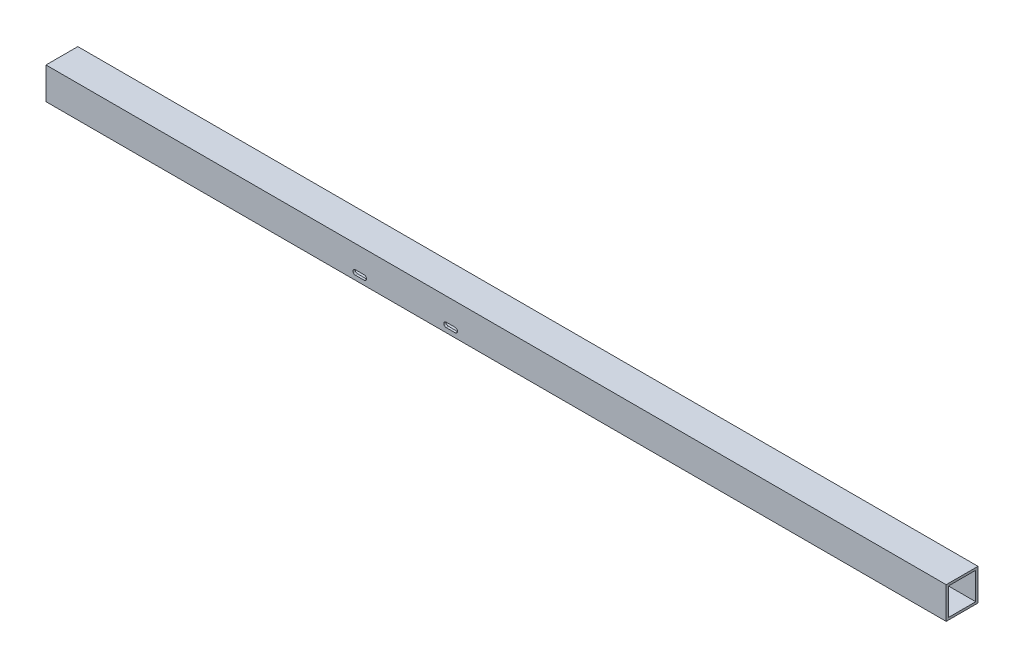
ISO-10303-21;
HEADER;
FILE_DESCRIPTION(('STEP AP214'),'2;1');
FILE_NAME('part.step','',(''),(''),'','','');
FILE_SCHEMA(('AUTOMOTIVE_DESIGN { 1 0 10303 214 1 1 1 1 }'));
ENDSEC;
DATA;
#1=APPLICATION_CONTEXT('core data for automotive mechanical design processes');
#2=APPLICATION_PROTOCOL_DEFINITION('international standard','automotive_design',2000,#1);
#3=PRODUCT_CONTEXT('',#1,'mechanical');
#4=PRODUCT('Part','Part','',(#3));
#5=PRODUCT_RELATED_PRODUCT_CATEGORY('part','',(#4));
#6=PRODUCT_DEFINITION_FORMATION('','',#4);
#7=PRODUCT_DEFINITION_CONTEXT('part definition',#1,'design');
#8=PRODUCT_DEFINITION('design','',#6,#7);
#9=PRODUCT_DEFINITION_SHAPE('','',#8);
#10=(LENGTH_UNIT() NAMED_UNIT(*) SI_UNIT(.MILLI.,.METRE.));
#11=(NAMED_UNIT(*) PLANE_ANGLE_UNIT() SI_UNIT($,.RADIAN.));
#12=(NAMED_UNIT(*) SI_UNIT($,.STERADIAN.) SOLID_ANGLE_UNIT());
#13=UNCERTAINTY_MEASURE_WITH_UNIT(LENGTH_MEASURE(1.E-05),#10,'distance_accuracy_value','');
#14=(GEOMETRIC_REPRESENTATION_CONTEXT(3) GLOBAL_UNCERTAINTY_ASSIGNED_CONTEXT((#13)) GLOBAL_UNIT_ASSIGNED_CONTEXT((#10,
#11,#12)) REPRESENTATION_CONTEXT('',''));
#15=CARTESIAN_POINT('',(0.,0.,0.));
#16=DIRECTION('',(0.,0.,1.));
#17=DIRECTION('',(1.,0.,0.));
#18=AXIS2_PLACEMENT_3D('',#15,#16,#17);
#19=CARTESIAN_POINT('',(628.65,0.,0.));
#20=DIRECTION('',(1.,0.,0.));
#21=DIRECTION('',(0.,0.,-1.));
#22=AXIS2_PLACEMENT_3D('',#19,#20,#21);
#23=PLANE('',#22);
#24=DIRECTION('',(0.,-1.,0.));
#25=VECTOR('',#24,1.);
#26=CARTESIAN_POINT('',(628.65,44.45,0.));
#27=LINE('',#26,#25);
#28=CARTESIAN_POINT('',(628.65,44.45,0.));
#29=VERTEX_POINT('',#28);
#30=CARTESIAN_POINT('',(628.65,0.,0.));
#31=VERTEX_POINT('',#30);
#32=EDGE_CURVE('E250',#29,#31,#27,.T.);
#33=ORIENTED_EDGE('',*,*,#32,.T.);
#34=DIRECTION('',(0.,0.,-1.));
#35=VECTOR('',#34,1.);
#36=CARTESIAN_POINT('',(628.65,0.,0.));
#37=LINE('',#36,#35);
#38=CARTESIAN_POINT('',(628.65,0.,-44.45));
#39=VERTEX_POINT('',#38);
#40=EDGE_CURVE('E253',#31,#39,#37,.T.);
#41=ORIENTED_EDGE('',*,*,#40,.T.);
#42=DIRECTION('',(0.,1.,0.));
#43=VECTOR('',#42,1.);
#44=CARTESIAN_POINT('',(628.65,0.,-44.45));
#45=LINE('',#44,#43);
#46=CARTESIAN_POINT('',(628.65,44.45,-44.45));
#47=VERTEX_POINT('',#46);
#48=EDGE_CURVE('E256',#39,#47,#45,.T.);
#49=ORIENTED_EDGE('',*,*,#48,.T.);
#50=DIRECTION('',(0.,0.,1.));
#51=VECTOR('',#50,1.);
#52=CARTESIAN_POINT('',(628.65,44.45,-44.45));
#53=LINE('',#52,#51);
#54=EDGE_CURVE('E258',#47,#29,#53,.T.);
#55=ORIENTED_EDGE('',*,*,#54,.T.);
#56=EDGE_LOOP('',(#33,#41,#49,#55));
#57=FACE_BOUND('',#56,.T.);
#58=DIRECTION('',(0.,0.,1.));
#59=VECTOR('',#58,1.);
#60=CARTESIAN_POINT('',(628.65,41.275,-41.275));
#61=LINE('',#60,#59);
#62=CARTESIAN_POINT('',(628.65,41.275,-41.275));
#63=VERTEX_POINT('',#62);
#64=CARTESIAN_POINT('',(628.65,41.275,-3.175));
#65=VERTEX_POINT('',#64);
#66=EDGE_CURVE('E221',#63,#65,#61,.T.);
#67=ORIENTED_EDGE('',*,*,#66,.F.);
#68=DIRECTION('',(0.,1.,0.));
#69=VECTOR('',#68,1.);
#70=CARTESIAN_POINT('',(628.65,3.175,-41.275));
#71=LINE('',#70,#69);
#72=CARTESIAN_POINT('',(628.65,3.175,-41.275));
#73=VERTEX_POINT('',#72);
#74=EDGE_CURVE('E219',#73,#63,#71,.T.);
#75=ORIENTED_EDGE('',*,*,#74,.F.);
#76=DIRECTION('',(0.,0.,-1.));
#77=VECTOR('',#76,1.);
#78=CARTESIAN_POINT('',(628.65,3.175,-3.17500000000001));
#79=LINE('',#78,#77);
#80=CARTESIAN_POINT('',(628.65,3.175,-3.17500000000001));
#81=VERTEX_POINT('',#80);
#82=EDGE_CURVE('E227',#81,#73,#79,.T.);
#83=ORIENTED_EDGE('',*,*,#82,.F.);
#84=DIRECTION('',(0.,-1.,0.));
#85=VECTOR('',#84,1.);
#86=CARTESIAN_POINT('',(628.65,41.275,-3.175));
#87=LINE('',#86,#85);
#88=EDGE_CURVE('E224',#65,#81,#87,.T.);
#89=ORIENTED_EDGE('',*,*,#88,.F.);
#90=EDGE_LOOP('',(#67,#75,#83,#89));
#91=FACE_BOUND('',#90,.T.);
#92=ADVANCED_FACE('F35',(#57,#91),#23,.T.);
#93=CARTESIAN_POINT('',(-628.65,0.,0.));
#94=DIRECTION('',(1.,0.,0.));
#95=DIRECTION('',(0.,0.,-1.));
#96=AXIS2_PLACEMENT_3D('',#93,#94,#95);
#97=PLANE('',#96);
#98=DIRECTION('',(0.,-1.,0.));
#99=VECTOR('',#98,1.);
#100=CARTESIAN_POINT('',(-628.65,44.45,0.));
#101=LINE('',#100,#99);
#102=CARTESIAN_POINT('',(-628.65,44.45,0.));
#103=VERTEX_POINT('',#102);
#104=CARTESIAN_POINT('',(-628.65,0.,0.));
#105=VERTEX_POINT('',#104);
#106=EDGE_CURVE('E249',#103,#105,#101,.T.);
#107=ORIENTED_EDGE('',*,*,#106,.F.);
#108=DIRECTION('',(0.,0.,1.));
#109=VECTOR('',#108,1.);
#110=CARTESIAN_POINT('',(-628.65,44.45,-44.45));
#111=LINE('',#110,#109);
#112=CARTESIAN_POINT('',(-628.65,44.45,-44.45));
#113=VERTEX_POINT('',#112);
#114=EDGE_CURVE('E254',#113,#103,#111,.T.);
#115=ORIENTED_EDGE('',*,*,#114,.F.);
#116=DIRECTION('',(0.,1.,0.));
#117=VECTOR('',#116,1.);
#118=CARTESIAN_POINT('',(-628.65,0.,-44.45));
#119=LINE('',#118,#117);
#120=CARTESIAN_POINT('',(-628.65,0.,-44.45));
#121=VERTEX_POINT('',#120);
#122=EDGE_CURVE('E265',#121,#113,#119,.T.);
#123=ORIENTED_EDGE('',*,*,#122,.F.);
#124=DIRECTION('',(0.,0.,-1.));
#125=VECTOR('',#124,1.);
#126=CARTESIAN_POINT('',(-628.65,0.,0.));
#127=LINE('',#126,#125);
#128=EDGE_CURVE('E263',#105,#121,#127,.T.);
#129=ORIENTED_EDGE('',*,*,#128,.F.);
#130=EDGE_LOOP('',(#107,#115,#123,#129));
#131=FACE_BOUND('',#130,.T.);
#132=DIRECTION('',(0.,1.,0.));
#133=VECTOR('',#132,1.);
#134=CARTESIAN_POINT('',(-628.65,3.175,-41.275));
#135=LINE('',#134,#133);
#136=CARTESIAN_POINT('',(-628.65,3.175,-41.275));
#137=VERTEX_POINT('',#136);
#138=CARTESIAN_POINT('',(-628.65,41.275,-41.275));
#139=VERTEX_POINT('',#138);
#140=EDGE_CURVE('E192',#137,#139,#135,.T.);
#141=ORIENTED_EDGE('',*,*,#140,.T.);
#142=DIRECTION('',(0.,0.,1.));
#143=VECTOR('',#142,1.);
#144=CARTESIAN_POINT('',(-628.65,41.275,-41.275));
#145=LINE('',#144,#143);
#146=CARTESIAN_POINT('',(-628.65,41.275,-3.175));
#147=VERTEX_POINT('',#146);
#148=EDGE_CURVE('E232',#139,#147,#145,.T.);
#149=ORIENTED_EDGE('',*,*,#148,.T.);
#150=DIRECTION('',(0.,-1.,0.));
#151=VECTOR('',#150,1.);
#152=CARTESIAN_POINT('',(-628.65,41.275,-3.175));
#153=LINE('',#152,#151);
#154=CARTESIAN_POINT('',(-628.65,3.175,-3.17500000000001));
#155=VERTEX_POINT('',#154);
#156=EDGE_CURVE('E235',#147,#155,#153,.T.);
#157=ORIENTED_EDGE('',*,*,#156,.T.);
#158=DIRECTION('',(0.,0.,-1.));
#159=VECTOR('',#158,1.);
#160=CARTESIAN_POINT('',(-628.65,3.175,-3.17500000000001));
#161=LINE('',#160,#159);
#162=EDGE_CURVE('E222',#155,#137,#161,.T.);
#163=ORIENTED_EDGE('',*,*,#162,.T.);
#164=EDGE_LOOP('',(#141,#149,#157,#163));
#165=FACE_BOUND('',#164,.T.);
#166=ADVANCED_FACE('F283',(#131,#165),#97,.F.);
#167=CARTESIAN_POINT('',(628.65,44.45,0.));
#168=DIRECTION('',(0.,0.,-1.));
#169=DIRECTION('',(0.,1.,0.));
#170=AXIS2_PLACEMENT_3D('',#167,#168,#169);
#171=PLANE('',#170);
#172=CARTESIAN_POINT('',(-184.277,9.52499999999996,0.));
#173=DIRECTION('',(0.,0.,1.));
#174=DIRECTION('',(1.,0.,0.));
#175=AXIS2_PLACEMENT_3D('',#172,#173,#174);
#176=CIRCLE('',#175,3.302);
#177=CARTESIAN_POINT('',(-184.277,6.22299999999996,0.));
#178=VERTEX_POINT('',#177);
#179=CARTESIAN_POINT('',(-184.277,12.827,0.));
#180=VERTEX_POINT('',#179);
#181=EDGE_CURVE('E164',#178,#180,#176,.T.);
#182=ORIENTED_EDGE('',*,*,#181,.F.);
#183=DIRECTION('',(1.,0.,0.));
#184=VECTOR('',#183,1.);
#185=CARTESIAN_POINT('',(-196.723,6.22299999999996,0.));
#186=LINE('',#185,#184);
#187=CARTESIAN_POINT('',(-196.723,6.22299999999996,0.));
#188=VERTEX_POINT('',#187);
#189=EDGE_CURVE('E182',#188,#178,#186,.T.);
#190=ORIENTED_EDGE('',*,*,#189,.F.);
#191=CARTESIAN_POINT('',(-196.723,9.52499999999996,0.));
#192=DIRECTION('',(0.,0.,1.));
#193=DIRECTION('',(1.,0.,0.));
#194=AXIS2_PLACEMENT_3D('',#191,#192,#193);
#195=CIRCLE('',#194,3.302);
#196=CARTESIAN_POINT('',(-196.723,12.827,0.));
#197=VERTEX_POINT('',#196);
#198=EDGE_CURVE('E179',#197,#188,#195,.T.);
#199=ORIENTED_EDGE('',*,*,#198,.F.);
#200=DIRECTION('',(-1.,0.,0.));
#201=VECTOR('',#200,1.);
#202=CARTESIAN_POINT('',(-196.723,12.827,0.));
#203=LINE('',#202,#201);
#204=EDGE_CURVE('E50',#180,#197,#203,.T.);
#205=ORIENTED_EDGE('',*,*,#204,.F.);
#206=EDGE_LOOP('',(#182,#190,#199,#205));
#207=FACE_BOUND('',#206,.T.);
#208=CARTESIAN_POINT('',(-57.277,9.52499999999996,0.));
#209=DIRECTION('',(0.,0.,1.));
#210=DIRECTION('',(1.,0.,0.));
#211=AXIS2_PLACEMENT_3D('',#208,#209,#210);
#212=CIRCLE('',#211,3.302);
#213=CARTESIAN_POINT('',(-57.277,6.22299999999997,0.));
#214=VERTEX_POINT('',#213);
#215=CARTESIAN_POINT('',(-57.277,12.827,0.));
#216=VERTEX_POINT('',#215);
#217=EDGE_CURVE('E208',#214,#216,#212,.T.);
#218=ORIENTED_EDGE('',*,*,#217,.F.);
#219=DIRECTION('',(1.,0.,0.));
#220=VECTOR('',#219,1.);
#221=CARTESIAN_POINT('',(-69.723,6.22299999999997,0.));
#222=LINE('',#221,#220);
#223=CARTESIAN_POINT('',(-69.723,6.22299999999997,0.));
#224=VERTEX_POINT('',#223);
#225=EDGE_CURVE('E205',#224,#214,#222,.T.);
#226=ORIENTED_EDGE('',*,*,#225,.F.);
#227=CARTESIAN_POINT('',(-69.723,9.52499999999996,0.));
#228=DIRECTION('',(0.,0.,1.));
#229=DIRECTION('',(1.,0.,0.));
#230=AXIS2_PLACEMENT_3D('',#227,#228,#229);
#231=CIRCLE('',#230,3.302);
#232=CARTESIAN_POINT('',(-69.723,12.827,0.));
#233=VERTEX_POINT('',#232);
#234=EDGE_CURVE('E202',#233,#224,#231,.T.);
#235=ORIENTED_EDGE('',*,*,#234,.F.);
#236=DIRECTION('',(-1.,0.,0.));
#237=VECTOR('',#236,1.);
#238=CARTESIAN_POINT('',(-69.723,12.827,0.));
#239=LINE('',#238,#237);
#240=EDGE_CURVE('E58',#216,#233,#239,.T.);
#241=ORIENTED_EDGE('',*,*,#240,.F.);
#242=EDGE_LOOP('',(#218,#226,#235,#241));
#243=FACE_BOUND('',#242,.T.);
#244=ORIENTED_EDGE('',*,*,#106,.T.);
#245=DIRECTION('',(-1.,0.,0.));
#246=VECTOR('',#245,1.);
#247=CARTESIAN_POINT('',(628.65,0.,0.));
#248=LINE('',#247,#246);
#249=EDGE_CURVE('E11',#31,#105,#248,.T.);
#250=ORIENTED_EDGE('',*,*,#249,.F.);
#251=ORIENTED_EDGE('',*,*,#32,.F.);
#252=DIRECTION('',(-1.,0.,0.));
#253=VECTOR('',#252,1.);
#254=CARTESIAN_POINT('',(628.65,44.45,0.));
#255=LINE('',#254,#253);
#256=EDGE_CURVE('E260',#29,#103,#255,.T.);
#257=ORIENTED_EDGE('',*,*,#256,.T.);
#258=EDGE_LOOP('',(#244,#250,#251,#257));
#259=FACE_BOUND('',#258,.T.);
#260=ADVANCED_FACE('F37',(#207,#243,#259),#171,.F.);
#261=CARTESIAN_POINT('',(628.65,0.,0.));
#262=DIRECTION('',(0.,1.,0.));
#263=DIRECTION('',(0.,0.,1.));
#264=AXIS2_PLACEMENT_3D('',#261,#262,#263);
#265=PLANE('',#264);
#266=ORIENTED_EDGE('',*,*,#128,.T.);
#267=DIRECTION('',(-1.,0.,0.));
#268=VECTOR('',#267,1.);
#269=CARTESIAN_POINT('',(628.65,0.,-44.45));
#270=LINE('',#269,#268);
#271=EDGE_CURVE('E43',#39,#121,#270,.T.);
#272=ORIENTED_EDGE('',*,*,#271,.F.);
#273=ORIENTED_EDGE('',*,*,#40,.F.);
#274=ORIENTED_EDGE('',*,*,#249,.T.);
#275=EDGE_LOOP('',(#266,#272,#273,#274));
#276=FACE_BOUND('',#275,.T.);
#277=ADVANCED_FACE('F294',(#276),#265,.F.);
#278=CARTESIAN_POINT('',(628.65,0.,-44.45));
#279=DIRECTION('',(0.,0.,1.));
#280=DIRECTION('',(0.,-1.,0.));
#281=AXIS2_PLACEMENT_3D('',#278,#279,#280);
#282=PLANE('',#281);
#283=ORIENTED_EDGE('',*,*,#122,.T.);
#284=DIRECTION('',(-1.,0.,0.));
#285=VECTOR('',#284,1.);
#286=CARTESIAN_POINT('',(628.65,44.45,-44.45));
#287=LINE('',#286,#285);
#288=EDGE_CURVE('E270',#47,#113,#287,.T.);
#289=ORIENTED_EDGE('',*,*,#288,.F.);
#290=ORIENTED_EDGE('',*,*,#48,.F.);
#291=ORIENTED_EDGE('',*,*,#271,.T.);
#292=EDGE_LOOP('',(#283,#289,#290,#291));
#293=FACE_BOUND('',#292,.T.);
#294=ADVANCED_FACE('F277',(#293),#282,.F.);
#295=CARTESIAN_POINT('',(628.65,44.45,-44.45));
#296=DIRECTION('',(0.,-1.,0.));
#297=DIRECTION('',(0.,0.,-1.));
#298=AXIS2_PLACEMENT_3D('',#295,#296,#297);
#299=PLANE('',#298);
#300=ORIENTED_EDGE('',*,*,#114,.T.);
#301=ORIENTED_EDGE('',*,*,#256,.F.);
#302=ORIENTED_EDGE('',*,*,#54,.F.);
#303=ORIENTED_EDGE('',*,*,#288,.T.);
#304=EDGE_LOOP('',(#300,#301,#302,#303));
#305=FACE_BOUND('',#304,.T.);
#306=ADVANCED_FACE('F287',(#305),#299,.F.);
#307=CARTESIAN_POINT('',(628.65,3.175,-41.275));
#308=DIRECTION('',(0.,0.,1.));
#309=DIRECTION('',(0.,-1.,0.));
#310=AXIS2_PLACEMENT_3D('',#307,#308,#309);
#311=PLANE('',#310);
#312=ORIENTED_EDGE('',*,*,#140,.F.);
#313=DIRECTION('',(-1.,0.,0.));
#314=VECTOR('',#313,1.);
#315=CARTESIAN_POINT('',(628.65,3.175,-41.275));
#316=LINE('',#315,#314);
#317=EDGE_CURVE('E229',#73,#137,#316,.T.);
#318=ORIENTED_EDGE('',*,*,#317,.F.);
#319=ORIENTED_EDGE('',*,*,#74,.T.);
#320=DIRECTION('',(-1.,0.,0.));
#321=VECTOR('',#320,1.);
#322=CARTESIAN_POINT('',(628.65,41.275,-41.275));
#323=LINE('',#322,#321);
#324=EDGE_CURVE('E246',#63,#139,#323,.T.);
#325=ORIENTED_EDGE('',*,*,#324,.T.);
#326=EDGE_LOOP('',(#312,#318,#319,#325));
#327=FACE_BOUND('',#326,.T.);
#328=ADVANCED_FACE('F310',(#327),#311,.T.);
#329=CARTESIAN_POINT('',(628.65,41.275,-41.275));
#330=DIRECTION('',(0.,-1.,0.));
#331=DIRECTION('',(0.,0.,-1.));
#332=AXIS2_PLACEMENT_3D('',#329,#330,#331);
#333=PLANE('',#332);
#334=ORIENTED_EDGE('',*,*,#148,.F.);
#335=ORIENTED_EDGE('',*,*,#324,.F.);
#336=ORIENTED_EDGE('',*,*,#66,.T.);
#337=DIRECTION('',(-1.,0.,0.));
#338=VECTOR('',#337,1.);
#339=CARTESIAN_POINT('',(628.65,41.275,-3.175));
#340=LINE('',#339,#338);
#341=EDGE_CURVE('E244',#65,#147,#340,.T.);
#342=ORIENTED_EDGE('',*,*,#341,.T.);
#343=EDGE_LOOP('',(#334,#335,#336,#342));
#344=FACE_BOUND('',#343,.T.);
#345=ADVANCED_FACE('F317',(#344),#333,.T.);
#346=CARTESIAN_POINT('',(628.65,41.275,-3.175));
#347=DIRECTION('',(0.,0.,-1.));
#348=DIRECTION('',(0.,1.,0.));
#349=AXIS2_PLACEMENT_3D('',#346,#347,#348);
#350=PLANE('',#349);
#351=DIRECTION('',(1.,0.,0.));
#352=VECTOR('',#351,1.);
#353=CARTESIAN_POINT('',(-196.723,6.22299999999996,-3.175));
#354=LINE('',#353,#352);
#355=CARTESIAN_POINT('',(-196.723,6.22299999999996,-3.175));
#356=VERTEX_POINT('',#355);
#357=CARTESIAN_POINT('',(-184.277,6.22299999999996,-3.175));
#358=VERTEX_POINT('',#357);
#359=EDGE_CURVE('E171',#356,#358,#354,.T.);
#360=ORIENTED_EDGE('',*,*,#359,.T.);
#361=CARTESIAN_POINT('',(-184.277,9.52499999999996,-3.175));
#362=DIRECTION('',(0.,0.,-1.));
#363=DIRECTION('',(0.,1.,0.));
#364=AXIS2_PLACEMENT_3D('',#361,#362,#363);
#365=CIRCLE('',#364,3.302);
#366=CARTESIAN_POINT('',(-184.277,12.827,-3.175));
#367=VERTEX_POINT('',#366);
#368=EDGE_CURVE('E158',#358,#367,#365,.F.);
#369=ORIENTED_EDGE('',*,*,#368,.T.);
#370=DIRECTION('',(-1.,0.,0.));
#371=VECTOR('',#370,1.);
#372=CARTESIAN_POINT('',(-196.723,12.827,-3.175));
#373=LINE('',#372,#371);
#374=CARTESIAN_POINT('',(-196.723,12.827,-3.175));
#375=VERTEX_POINT('',#374);
#376=EDGE_CURVE('E148',#367,#375,#373,.T.);
#377=ORIENTED_EDGE('',*,*,#376,.T.);
#378=CARTESIAN_POINT('',(-196.723,9.52499999999996,-3.175));
#379=DIRECTION('',(0.,0.,-1.));
#380=DIRECTION('',(0.,1.,0.));
#381=AXIS2_PLACEMENT_3D('',#378,#379,#380);
#382=CIRCLE('',#381,3.302);
#383=EDGE_CURVE('E157',#375,#356,#382,.F.);
#384=ORIENTED_EDGE('',*,*,#383,.T.);
#385=EDGE_LOOP('',(#360,#369,#377,#384));
#386=FACE_BOUND('',#385,.T.);
#387=DIRECTION('',(1.,0.,0.));
#388=VECTOR('',#387,1.);
#389=CARTESIAN_POINT('',(-69.723,6.22299999999997,-3.175));
#390=LINE('',#389,#388);
#391=CARTESIAN_POINT('',(-69.723,6.22299999999997,-3.175));
#392=VERTEX_POINT('',#391);
#393=CARTESIAN_POINT('',(-57.277,6.22299999999997,-3.175));
#394=VERTEX_POINT('',#393);
#395=EDGE_CURVE('E172',#392,#394,#390,.T.);
#396=ORIENTED_EDGE('',*,*,#395,.T.);
#397=CARTESIAN_POINT('',(-57.277,9.52499999999996,-3.175));
#398=DIRECTION('',(0.,0.,-1.));
#399=DIRECTION('',(0.,1.,0.));
#400=AXIS2_PLACEMENT_3D('',#397,#398,#399);
#401=CIRCLE('',#400,3.302);
#402=CARTESIAN_POINT('',(-57.277,12.827,-3.175));
#403=VERTEX_POINT('',#402);
#404=EDGE_CURVE('E193',#394,#403,#401,.F.);
#405=ORIENTED_EDGE('',*,*,#404,.T.);
#406=DIRECTION('',(-1.,0.,0.));
#407=VECTOR('',#406,1.);
#408=CARTESIAN_POINT('',(-69.723,12.827,-3.175));
#409=LINE('',#408,#407);
#410=CARTESIAN_POINT('',(-69.723,12.827,-3.175));
#411=VERTEX_POINT('',#410);
#412=EDGE_CURVE('E196',#403,#411,#409,.T.);
#413=ORIENTED_EDGE('',*,*,#412,.T.);
#414=CARTESIAN_POINT('',(-69.723,9.52499999999996,-3.175));
#415=DIRECTION('',(0.,0.,-1.));
#416=DIRECTION('',(0.,1.,0.));
#417=AXIS2_PLACEMENT_3D('',#414,#415,#416);
#418=CIRCLE('',#417,3.302);
#419=EDGE_CURVE('E199',#411,#392,#418,.F.);
#420=ORIENTED_EDGE('',*,*,#419,.T.);
#421=EDGE_LOOP('',(#396,#405,#413,#420));
#422=FACE_BOUND('',#421,.T.);
#423=ORIENTED_EDGE('',*,*,#156,.F.);
#424=ORIENTED_EDGE('',*,*,#341,.F.);
#425=ORIENTED_EDGE('',*,*,#88,.T.);
#426=DIRECTION('',(-1.,0.,0.));
#427=VECTOR('',#426,1.);
#428=CARTESIAN_POINT('',(628.65,3.175,-3.17500000000001));
#429=LINE('',#428,#427);
#430=EDGE_CURVE('E242',#81,#155,#429,.T.);
#431=ORIENTED_EDGE('',*,*,#430,.T.);
#432=EDGE_LOOP('',(#423,#424,#425,#431));
#433=FACE_BOUND('',#432,.T.);
#434=ADVANCED_FACE('F168',(#386,#422,#433),#350,.T.);
#435=CARTESIAN_POINT('',(628.65,3.175,-3.17500000000001));
#436=DIRECTION('',(0.,1.,0.));
#437=DIRECTION('',(0.,0.,1.));
#438=AXIS2_PLACEMENT_3D('',#435,#436,#437);
#439=PLANE('',#438);
#440=ORIENTED_EDGE('',*,*,#162,.F.);
#441=ORIENTED_EDGE('',*,*,#430,.F.);
#442=ORIENTED_EDGE('',*,*,#82,.T.);
#443=ORIENTED_EDGE('',*,*,#317,.T.);
#444=EDGE_LOOP('',(#440,#441,#442,#443));
#445=FACE_BOUND('',#444,.T.);
#446=ADVANCED_FACE('F328',(#445),#439,.T.);
#447=CARTESIAN_POINT('',(-69.723,6.22299999999997,-44.451));
#448=DIRECTION('',(0.,-1.,0.));
#449=DIRECTION('',(0.,0.,-1.));
#450=AXIS2_PLACEMENT_3D('',#447,#448,#449);
#451=PLANE('',#450);
#452=DIRECTION('',(0.,0.,1.));
#453=VECTOR('',#452,1.);
#454=CARTESIAN_POINT('',(-69.723,6.22299999999997,-44.451));
#455=LINE('',#454,#453);
#456=EDGE_CURVE('E212',#392,#224,#455,.T.);
#457=ORIENTED_EDGE('',*,*,#456,.T.);
#458=ORIENTED_EDGE('',*,*,#225,.T.);
#459=DIRECTION('',(0.,0.,1.));
#460=VECTOR('',#459,1.);
#461=CARTESIAN_POINT('',(-57.277,6.22299999999997,-44.451));
#462=LINE('',#461,#460);
#463=EDGE_CURVE('E216',#394,#214,#462,.T.);
#464=ORIENTED_EDGE('',*,*,#463,.F.);
#465=ORIENTED_EDGE('',*,*,#395,.F.);
#466=EDGE_LOOP('',(#457,#458,#464,#465));
#467=FACE_BOUND('',#466,.T.);
#468=ADVANCED_FACE('F341',(#467),#451,.F.);
#469=CARTESIAN_POINT('',(-57.277,9.52499999999996,-44.451));
#470=DIRECTION('',(0.,0.,1.));
#471=DIRECTION('',(1.,0.,0.));
#472=AXIS2_PLACEMENT_3D('',#469,#470,#471);
#473=CYLINDRICAL_SURFACE('',#472,3.302);
#474=ORIENTED_EDGE('',*,*,#463,.T.);
#475=ORIENTED_EDGE('',*,*,#217,.T.);
#476=DIRECTION('',(0.,0.,1.));
#477=VECTOR('',#476,1.);
#478=CARTESIAN_POINT('',(-57.277,12.827,-44.451));
#479=LINE('',#478,#477);
#480=EDGE_CURVE('E214',#403,#216,#479,.T.);
#481=ORIENTED_EDGE('',*,*,#480,.F.);
#482=ORIENTED_EDGE('',*,*,#404,.F.);
#483=EDGE_LOOP('',(#474,#475,#481,#482));
#484=FACE_BOUND('',#483,.T.);
#485=ADVANCED_FACE('F352',(#484),#473,.F.);
#486=CARTESIAN_POINT('',(-69.723,12.827,-44.451));
#487=DIRECTION('',(0.,1.,0.));
#488=DIRECTION('',(0.,0.,1.));
#489=AXIS2_PLACEMENT_3D('',#486,#487,#488);
#490=PLANE('',#489);
#491=ORIENTED_EDGE('',*,*,#480,.T.);
#492=ORIENTED_EDGE('',*,*,#240,.T.);
#493=DIRECTION('',(0.,0.,1.));
#494=VECTOR('',#493,1.);
#495=CARTESIAN_POINT('',(-69.723,12.827,-44.451));
#496=LINE('',#495,#494);
#497=EDGE_CURVE('E175',#411,#233,#496,.T.);
#498=ORIENTED_EDGE('',*,*,#497,.F.);
#499=ORIENTED_EDGE('',*,*,#412,.F.);
#500=EDGE_LOOP('',(#491,#492,#498,#499));
#501=FACE_BOUND('',#500,.T.);
#502=ADVANCED_FACE('F348',(#501),#490,.F.);
#503=CARTESIAN_POINT('',(-69.723,9.52499999999996,-44.451));
#504=DIRECTION('',(0.,0.,1.));
#505=DIRECTION('',(1.,0.,0.));
#506=AXIS2_PLACEMENT_3D('',#503,#504,#505);
#507=CYLINDRICAL_SURFACE('',#506,3.302);
#508=ORIENTED_EDGE('',*,*,#497,.T.);
#509=ORIENTED_EDGE('',*,*,#234,.T.);
#510=ORIENTED_EDGE('',*,*,#456,.F.);
#511=ORIENTED_EDGE('',*,*,#419,.F.);
#512=EDGE_LOOP('',(#508,#509,#510,#511));
#513=FACE_BOUND('',#512,.T.);
#514=ADVANCED_FACE('F344',(#513),#507,.F.);
#515=CARTESIAN_POINT('',(-196.723,6.22299999999996,-44.451));
#516=DIRECTION('',(0.,-1.,0.));
#517=DIRECTION('',(0.,0.,-1.));
#518=AXIS2_PLACEMENT_3D('',#515,#516,#517);
#519=PLANE('',#518);
#520=DIRECTION('',(0.,0.,1.));
#521=VECTOR('',#520,1.);
#522=CARTESIAN_POINT('',(-196.723,6.22299999999996,-44.451));
#523=LINE('',#522,#521);
#524=EDGE_CURVE('E187',#356,#188,#523,.T.);
#525=ORIENTED_EDGE('',*,*,#524,.T.);
#526=ORIENTED_EDGE('',*,*,#189,.T.);
#527=DIRECTION('',(0.,0.,1.));
#528=VECTOR('',#527,1.);
#529=CARTESIAN_POINT('',(-184.277,6.22299999999996,-44.451));
#530=LINE('',#529,#528);
#531=EDGE_CURVE('E165',#358,#178,#530,.T.);
#532=ORIENTED_EDGE('',*,*,#531,.F.);
#533=ORIENTED_EDGE('',*,*,#359,.F.);
#534=EDGE_LOOP('',(#525,#526,#532,#533));
#535=FACE_BOUND('',#534,.T.);
#536=ADVANCED_FACE('F347',(#535),#519,.F.);
#537=CARTESIAN_POINT('',(-184.277,9.52499999999996,-44.451));
#538=DIRECTION('',(0.,0.,1.));
#539=DIRECTION('',(1.,0.,0.));
#540=AXIS2_PLACEMENT_3D('',#537,#538,#539);
#541=CYLINDRICAL_SURFACE('',#540,3.302);
#542=ORIENTED_EDGE('',*,*,#531,.T.);
#543=ORIENTED_EDGE('',*,*,#181,.T.);
#544=DIRECTION('',(0.,0.,1.));
#545=VECTOR('',#544,1.);
#546=CARTESIAN_POINT('',(-184.277,12.827,-44.451));
#547=LINE('',#546,#545);
#548=EDGE_CURVE('E151',#367,#180,#547,.T.);
#549=ORIENTED_EDGE('',*,*,#548,.F.);
#550=ORIENTED_EDGE('',*,*,#368,.F.);
#551=EDGE_LOOP('',(#542,#543,#549,#550));
#552=FACE_BOUND('',#551,.T.);
#553=ADVANCED_FACE('F161',(#552),#541,.F.);
#554=CARTESIAN_POINT('',(-196.723,12.827,-44.451));
#555=DIRECTION('',(0.,1.,0.));
#556=DIRECTION('',(0.,0.,1.));
#557=AXIS2_PLACEMENT_3D('',#554,#555,#556);
#558=PLANE('',#557);
#559=ORIENTED_EDGE('',*,*,#548,.T.);
#560=ORIENTED_EDGE('',*,*,#204,.T.);
#561=DIRECTION('',(0.,0.,1.));
#562=VECTOR('',#561,1.);
#563=CARTESIAN_POINT('',(-196.723,12.827,-44.451));
#564=LINE('',#563,#562);
#565=EDGE_CURVE('E153',#375,#197,#564,.T.);
#566=ORIENTED_EDGE('',*,*,#565,.F.);
#567=ORIENTED_EDGE('',*,*,#376,.F.);
#568=EDGE_LOOP('',(#559,#560,#566,#567));
#569=FACE_BOUND('',#568,.T.);
#570=ADVANCED_FACE('F150',(#569),#558,.F.);
#571=CARTESIAN_POINT('',(-196.723,9.52499999999996,-44.451));
#572=DIRECTION('',(0.,0.,1.));
#573=DIRECTION('',(1.,0.,0.));
#574=AXIS2_PLACEMENT_3D('',#571,#572,#573);
#575=CYLINDRICAL_SURFACE('',#574,3.302);
#576=ORIENTED_EDGE('',*,*,#565,.T.);
#577=ORIENTED_EDGE('',*,*,#198,.T.);
#578=ORIENTED_EDGE('',*,*,#524,.F.);
#579=ORIENTED_EDGE('',*,*,#383,.F.);
#580=EDGE_LOOP('',(#576,#577,#578,#579));
#581=FACE_BOUND('',#580,.T.);
#582=ADVANCED_FACE('F359',(#581),#575,.F.);
#583=CLOSED_SHELL('',(#92,#166,#260,#277,#294,#306,#328,#345,#434,#446,#468,#485,#502,#514,#536,
#553,#570,#582));
#584=MANIFOLD_SOLID_BREP('B2',#583);
#585=ADVANCED_BREP_SHAPE_REPRESENTATION('',(#18,#584),#14);
#586=SHAPE_DEFINITION_REPRESENTATION(#9,#585);
ENDSEC;
END-ISO-10303-21;
